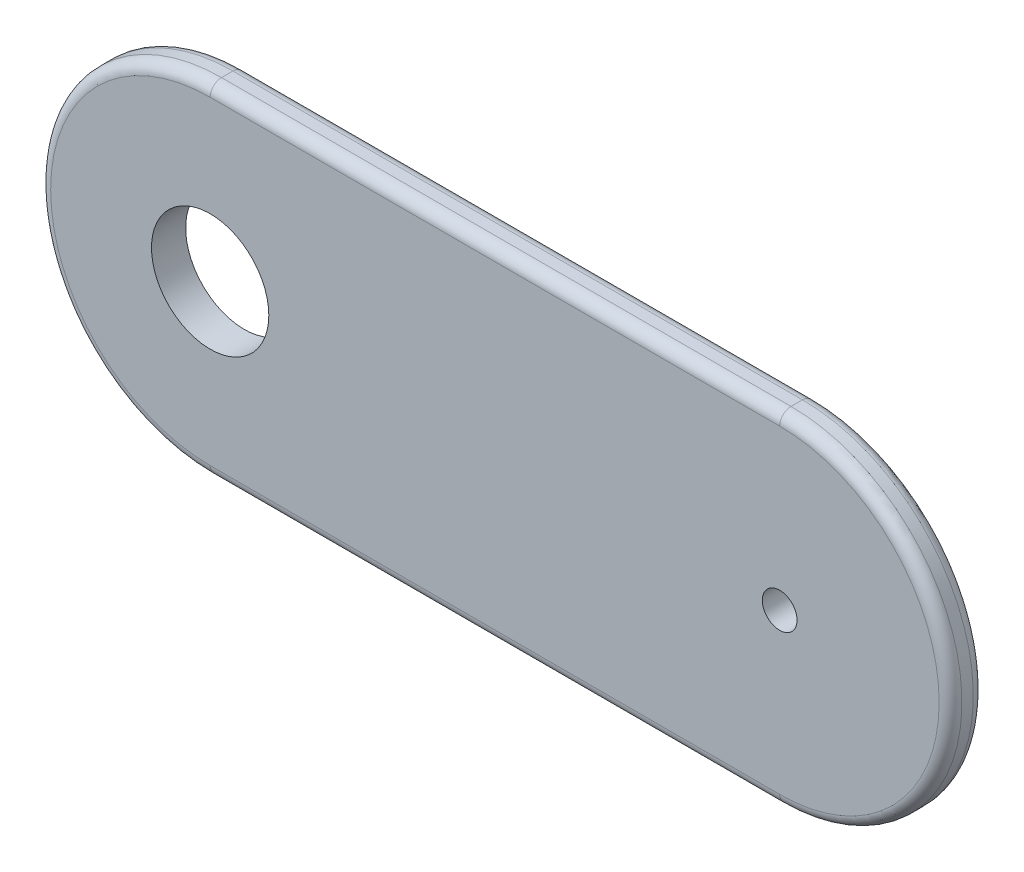
ISO-10303-21;
HEADER;
FILE_DESCRIPTION(('STEP AP214'),'2;1');
FILE_NAME('part.step','',(''),(''),'','','');
FILE_SCHEMA(('AUTOMOTIVE_DESIGN { 1 0 10303 214 1 1 1 1 }'));
ENDSEC;
DATA;
#1=APPLICATION_CONTEXT('core data for automotive mechanical design processes');
#2=APPLICATION_PROTOCOL_DEFINITION('international standard','automotive_design',2000,#1);
#3=PRODUCT_CONTEXT('',#1,'mechanical');
#4=PRODUCT('Part','Part','',(#3));
#5=PRODUCT_RELATED_PRODUCT_CATEGORY('part','',(#4));
#6=PRODUCT_DEFINITION_FORMATION('','',#4);
#7=PRODUCT_DEFINITION_CONTEXT('part definition',#1,'design');
#8=PRODUCT_DEFINITION('design','',#6,#7);
#9=PRODUCT_DEFINITION_SHAPE('','',#8);
#10=(LENGTH_UNIT() NAMED_UNIT(*) SI_UNIT(.MILLI.,.METRE.));
#11=(NAMED_UNIT(*) PLANE_ANGLE_UNIT() SI_UNIT($,.RADIAN.));
#12=(NAMED_UNIT(*) SI_UNIT($,.STERADIAN.) SOLID_ANGLE_UNIT());
#13=UNCERTAINTY_MEASURE_WITH_UNIT(LENGTH_MEASURE(1.E-05),#10,'distance_accuracy_value','');
#14=(GEOMETRIC_REPRESENTATION_CONTEXT(3) GLOBAL_UNCERTAINTY_ASSIGNED_CONTEXT((#13)) GLOBAL_UNIT_ASSIGNED_CONTEXT((#10,
#11,#12)) REPRESENTATION_CONTEXT('',''));
#15=CARTESIAN_POINT('',(0.,0.,0.));
#16=DIRECTION('',(0.,0.,1.));
#17=DIRECTION('',(1.,0.,0.));
#18=AXIS2_PLACEMENT_3D('',#15,#16,#17);
#19=CARTESIAN_POINT('',(0.,0.,3.));
#20=DIRECTION('',(0.,0.,-1.));
#21=DIRECTION('',(-1.,0.,0.));
#22=AXIS2_PLACEMENT_3D('',#19,#20,#21);
#23=CYLINDRICAL_SURFACE('',#22,15.);
#24=DIRECTION('',(0.,0.,-1.));
#25=VECTOR('',#24,1.);
#26=CARTESIAN_POINT('',(0.,15.,3.));
#27=LINE('',#26,#25);
#28=CARTESIAN_POINT('',(0.,15.,2.));
#29=VERTEX_POINT('',#28);
#30=CARTESIAN_POINT('',(0.,15.,1.));
#31=VERTEX_POINT('',#30);
#32=EDGE_CURVE('E175',#29,#31,#27,.T.);
#33=ORIENTED_EDGE('',*,*,#32,.T.);
#34=CARTESIAN_POINT('',(0.,0.,1.));
#35=DIRECTION('',(0.,0.,1.));
#36=DIRECTION('',(1.,0.,0.));
#37=AXIS2_PLACEMENT_3D('',#34,#35,#36);
#38=CIRCLE('',#37,15.);
#39=CARTESIAN_POINT('',(0.,-15.,1.));
#40=VERTEX_POINT('',#39);
#41=EDGE_CURVE('E127',#31,#40,#38,.T.);
#42=ORIENTED_EDGE('',*,*,#41,.T.);
#43=DIRECTION('',(0.,0.,-1.));
#44=VECTOR('',#43,1.);
#45=CARTESIAN_POINT('',(0.,-15.,3.));
#46=LINE('',#45,#44);
#47=CARTESIAN_POINT('',(0.,-15.,2.));
#48=VERTEX_POINT('',#47);
#49=EDGE_CURVE('E111',#48,#40,#46,.T.);
#50=ORIENTED_EDGE('',*,*,#49,.F.);
#51=CARTESIAN_POINT('',(0.,0.,2.));
#52=DIRECTION('',(0.,0.,1.));
#53=DIRECTION('',(1.,0.,0.));
#54=AXIS2_PLACEMENT_3D('',#51,#52,#53);
#55=CIRCLE('',#54,15.);
#56=EDGE_CURVE('E124',#48,#29,#55,.F.);
#57=ORIENTED_EDGE('',*,*,#56,.T.);
#58=EDGE_LOOP('',(#33,#42,#50,#57));
#59=FACE_BOUND('',#58,.T.);
#60=ADVANCED_FACE('F39',(#59),#23,.T.);
#61=CARTESIAN_POINT('',(0.,-15.,3.));
#62=DIRECTION('',(0.,1.,0.));
#63=DIRECTION('',(0.,0.,1.));
#64=AXIS2_PLACEMENT_3D('',#61,#62,#63);
#65=PLANE('',#64);
#66=ORIENTED_EDGE('',*,*,#49,.T.);
#67=DIRECTION('',(1.,0.,0.));
#68=VECTOR('',#67,1.);
#69=CARTESIAN_POINT('',(0.,-15.,1.));
#70=LINE('',#69,#68);
#71=CARTESIAN_POINT('',(50.,-15.,1.));
#72=VERTEX_POINT('',#71);
#73=EDGE_CURVE('E117',#40,#72,#70,.T.);
#74=ORIENTED_EDGE('',*,*,#73,.T.);
#75=DIRECTION('',(0.,0.,-1.));
#76=VECTOR('',#75,1.);
#77=CARTESIAN_POINT('',(50.,-15.,3.));
#78=LINE('',#77,#76);
#79=CARTESIAN_POINT('',(50.,-15.,2.));
#80=VERTEX_POINT('',#79);
#81=EDGE_CURVE('E113',#80,#72,#78,.T.);
#82=ORIENTED_EDGE('',*,*,#81,.F.);
#83=DIRECTION('',(1.,0.,0.));
#84=VECTOR('',#83,1.);
#85=CARTESIAN_POINT('',(0.,-15.,2.));
#86=LINE('',#85,#84);
#87=EDGE_CURVE('E108',#80,#48,#86,.F.);
#88=ORIENTED_EDGE('',*,*,#87,.T.);
#89=EDGE_LOOP('',(#66,#74,#82,#88));
#90=FACE_BOUND('',#89,.T.);
#91=ADVANCED_FACE('F110',(#90),#65,.F.);
#92=CARTESIAN_POINT('',(50.,0.,3.));
#93=DIRECTION('',(0.,0.,-1.));
#94=DIRECTION('',(-1.,0.,0.));
#95=AXIS2_PLACEMENT_3D('',#92,#93,#94);
#96=CYLINDRICAL_SURFACE('',#95,15.);
#97=ORIENTED_EDGE('',*,*,#81,.T.);
#98=CARTESIAN_POINT('',(50.,0.,1.));
#99=DIRECTION('',(0.,0.,1.));
#100=DIRECTION('',(1.,0.,0.));
#101=AXIS2_PLACEMENT_3D('',#98,#99,#100);
#102=CIRCLE('',#101,15.);
#103=CARTESIAN_POINT('',(50.,15.,1.));
#104=VERTEX_POINT('',#103);
#105=EDGE_CURVE('E196',#72,#104,#102,.T.);
#106=ORIENTED_EDGE('',*,*,#105,.T.);
#107=DIRECTION('',(0.,0.,-1.));
#108=VECTOR('',#107,1.);
#109=CARTESIAN_POINT('',(50.,15.,3.));
#110=LINE('',#109,#108);
#111=CARTESIAN_POINT('',(50.,15.,2.));
#112=VERTEX_POINT('',#111);
#113=EDGE_CURVE('E180',#112,#104,#110,.T.);
#114=ORIENTED_EDGE('',*,*,#113,.F.);
#115=CARTESIAN_POINT('',(50.,0.,2.));
#116=DIRECTION('',(0.,0.,1.));
#117=DIRECTION('',(1.,0.,0.));
#118=AXIS2_PLACEMENT_3D('',#115,#116,#117);
#119=CIRCLE('',#118,15.);
#120=EDGE_CURVE('E194',#112,#80,#119,.F.);
#121=ORIENTED_EDGE('',*,*,#120,.T.);
#122=EDGE_LOOP('',(#97,#106,#114,#121));
#123=FACE_BOUND('',#122,.T.);
#124=ADVANCED_FACE('F209',(#123),#96,.T.);
#125=CARTESIAN_POINT('',(0.,15.,3.));
#126=DIRECTION('',(0.,1.,0.));
#127=DIRECTION('',(0.,0.,1.));
#128=AXIS2_PLACEMENT_3D('',#125,#126,#127);
#129=PLANE('',#128);
#130=ORIENTED_EDGE('',*,*,#113,.T.);
#131=DIRECTION('',(1.,0.,0.));
#132=VECTOR('',#131,1.);
#133=CARTESIAN_POINT('',(0.,15.,1.));
#134=LINE('',#133,#132);
#135=EDGE_CURVE('E11',#104,#31,#134,.F.);
#136=ORIENTED_EDGE('',*,*,#135,.T.);
#137=ORIENTED_EDGE('',*,*,#32,.F.);
#138=DIRECTION('',(1.,0.,0.));
#139=VECTOR('',#138,1.);
#140=CARTESIAN_POINT('',(0.,15.,2.));
#141=LINE('',#140,#139);
#142=EDGE_CURVE('E48',#29,#112,#141,.T.);
#143=ORIENTED_EDGE('',*,*,#142,.T.);
#144=EDGE_LOOP('',(#130,#136,#137,#143));
#145=FACE_BOUND('',#144,.T.);
#146=ADVANCED_FACE('F206',(#145),#129,.T.);
#147=CARTESIAN_POINT('',(0.,0.,3.));
#148=DIRECTION('',(0.,0.,1.));
#149=DIRECTION('',(1.,0.,0.));
#150=AXIS2_PLACEMENT_3D('',#147,#148,#149);
#151=PLANE('',#150);
#152=CARTESIAN_POINT('',(0.,0.,3.));
#153=DIRECTION('',(0.,0.,1.));
#154=DIRECTION('',(1.,0.,0.));
#155=AXIS2_PLACEMENT_3D('',#152,#153,#154);
#156=CIRCLE('',#155,5.15);
#157=CARTESIAN_POINT('',(5.15,0.,3.));
#158=VERTEX_POINT('',#157);
#159=EDGE_CURVE('E139',#158,#158,#156,.T.);
#160=ORIENTED_EDGE('',*,*,#159,.F.);
#161=EDGE_LOOP('',(#160));
#162=FACE_BOUND('',#161,.T.);
#163=DIRECTION('',(1.,0.,0.));
#164=VECTOR('',#163,1.);
#165=CARTESIAN_POINT('',(0.,14.,3.));
#166=LINE('',#165,#164);
#167=CARTESIAN_POINT('',(50.,14.,3.));
#168=VERTEX_POINT('',#167);
#169=CARTESIAN_POINT('',(0.,14.,3.));
#170=VERTEX_POINT('',#169);
#171=EDGE_CURVE('E198',#168,#170,#166,.F.);
#172=ORIENTED_EDGE('',*,*,#171,.T.);
#173=CARTESIAN_POINT('',(0.,0.,3.));
#174=DIRECTION('',(0.,0.,1.));
#175=DIRECTION('',(1.,0.,0.));
#176=AXIS2_PLACEMENT_3D('',#173,#174,#175);
#177=CIRCLE('',#176,14.);
#178=CARTESIAN_POINT('',(0.,-14.,3.));
#179=VERTEX_POINT('',#178);
#180=EDGE_CURVE('E203',#170,#179,#177,.T.);
#181=ORIENTED_EDGE('',*,*,#180,.T.);
#182=DIRECTION('',(1.,0.,0.));
#183=VECTOR('',#182,1.);
#184=CARTESIAN_POINT('',(50.,-14.,3.));
#185=LINE('',#184,#183);
#186=CARTESIAN_POINT('',(50.,-14.,3.));
#187=VERTEX_POINT('',#186);
#188=EDGE_CURVE('E63',#179,#187,#185,.T.);
#189=ORIENTED_EDGE('',*,*,#188,.T.);
#190=CARTESIAN_POINT('',(50.,0.,3.));
#191=DIRECTION('',(0.,0.,1.));
#192=DIRECTION('',(1.,0.,0.));
#193=AXIS2_PLACEMENT_3D('',#190,#191,#192);
#194=CIRCLE('',#193,14.);
#195=EDGE_CURVE('E200',#187,#168,#194,.T.);
#196=ORIENTED_EDGE('',*,*,#195,.T.);
#197=EDGE_LOOP('',(#172,#181,#189,#196));
#198=FACE_BOUND('',#197,.T.);
#199=CARTESIAN_POINT('',(50.,0.,3.));
#200=DIRECTION('',(0.,0.,1.));
#201=DIRECTION('',(1.,0.,0.));
#202=AXIS2_PLACEMENT_3D('',#199,#200,#201);
#203=CIRCLE('',#202,1.525);
#204=CARTESIAN_POINT('',(51.525,0.,3.));
#205=VERTEX_POINT('',#204);
#206=EDGE_CURVE('E170',#205,#205,#203,.F.);
#207=ORIENTED_EDGE('',*,*,#206,.T.);
#208=EDGE_LOOP('',(#207));
#209=FACE_BOUND('',#208,.T.);
#210=ADVANCED_FACE('F212',(#162,#198,#209),#151,.T.);
#211=CARTESIAN_POINT('',(0.,0.,0.));
#212=DIRECTION('',(0.,0.,1.));
#213=DIRECTION('',(1.,0.,0.));
#214=AXIS2_PLACEMENT_3D('',#211,#212,#213);
#215=PLANE('',#214);
#216=CARTESIAN_POINT('',(0.,0.,0.));
#217=DIRECTION('',(0.,0.,1.));
#218=DIRECTION('',(1.,0.,0.));
#219=AXIS2_PLACEMENT_3D('',#216,#217,#218);
#220=CIRCLE('',#219,5.15);
#221=CARTESIAN_POINT('',(5.15,0.,0.));
#222=VERTEX_POINT('',#221);
#223=EDGE_CURVE('E43',#222,#222,#220,.T.);
#224=ORIENTED_EDGE('',*,*,#223,.T.);
#225=EDGE_LOOP('',(#224));
#226=FACE_BOUND('',#225,.T.);
#227=DIRECTION('',(1.,0.,0.));
#228=VECTOR('',#227,1.);
#229=CARTESIAN_POINT('',(0.,-14.,0.));
#230=LINE('',#229,#228);
#231=CARTESIAN_POINT('',(50.,-14.,0.));
#232=VERTEX_POINT('',#231);
#233=CARTESIAN_POINT('',(0.,-14.,0.));
#234=VERTEX_POINT('',#233);
#235=EDGE_CURVE('E189',#232,#234,#230,.F.);
#236=ORIENTED_EDGE('',*,*,#235,.T.);
#237=CARTESIAN_POINT('',(0.,0.,0.));
#238=DIRECTION('',(0.,0.,1.));
#239=DIRECTION('',(1.,0.,0.));
#240=AXIS2_PLACEMENT_3D('',#237,#238,#239);
#241=CIRCLE('',#240,14.);
#242=CARTESIAN_POINT('',(0.,14.,0.));
#243=VERTEX_POINT('',#242);
#244=EDGE_CURVE('E118',#234,#243,#241,.F.);
#245=ORIENTED_EDGE('',*,*,#244,.T.);
#246=DIRECTION('',(1.,0.,0.));
#247=VECTOR('',#246,1.);
#248=CARTESIAN_POINT('',(50.,14.,0.));
#249=LINE('',#248,#247);
#250=CARTESIAN_POINT('',(50.,14.,0.));
#251=VERTEX_POINT('',#250);
#252=EDGE_CURVE('E185',#243,#251,#249,.T.);
#253=ORIENTED_EDGE('',*,*,#252,.T.);
#254=CARTESIAN_POINT('',(50.,0.,0.));
#255=DIRECTION('',(0.,0.,1.));
#256=DIRECTION('',(1.,0.,0.));
#257=AXIS2_PLACEMENT_3D('',#254,#255,#256);
#258=CIRCLE('',#257,14.);
#259=EDGE_CURVE('E187',#251,#232,#258,.F.);
#260=ORIENTED_EDGE('',*,*,#259,.T.);
#261=EDGE_LOOP('',(#236,#245,#253,#260));
#262=FACE_BOUND('',#261,.T.);
#263=CARTESIAN_POINT('',(50.,0.,0.));
#264=DIRECTION('',(0.,0.,1.));
#265=DIRECTION('',(1.,0.,0.));
#266=AXIS2_PLACEMENT_3D('',#263,#264,#265);
#267=CIRCLE('',#266,1.525);
#268=CARTESIAN_POINT('',(51.525,0.,0.));
#269=VERTEX_POINT('',#268);
#270=EDGE_CURVE('E164',#269,#269,#267,.T.);
#271=ORIENTED_EDGE('',*,*,#270,.T.);
#272=EDGE_LOOP('',(#271));
#273=FACE_BOUND('',#272,.T.);
#274=ADVANCED_FACE('F257',(#226,#262,#273),#215,.F.);
#275=CARTESIAN_POINT('',(50.,0.,5.));
#276=DIRECTION('',(0.,0.,-1.));
#277=DIRECTION('',(-1.,0.,0.));
#278=AXIS2_PLACEMENT_3D('',#275,#276,#277);
#279=CYLINDRICAL_SURFACE('',#278,1.525);
#280=ORIENTED_EDGE('',*,*,#206,.F.);
#281=EDGE_LOOP('',(#280));
#282=FACE_BOUND('',#281,.T.);
#283=ORIENTED_EDGE('',*,*,#270,.F.);
#284=EDGE_LOOP('',(#283));
#285=FACE_BOUND('',#284,.T.);
#286=ADVANCED_FACE('F241',(#282,#285),#279,.F.);
#287=CARTESIAN_POINT('',(50.,0.,1.));
#288=DIRECTION('',(0.,0.,1.));
#289=DIRECTION('',(1.,0.,0.));
#290=AXIS2_PLACEMENT_3D('',#287,#288,#289);
#291=TOROIDAL_SURFACE('',#290,14.,1.);
#292=CARTESIAN_POINT('',(50.,-14.,1.));
#293=DIRECTION('',(-1.,0.,0.));
#294=DIRECTION('',(0.,0.,1.));
#295=AXIS2_PLACEMENT_3D('',#292,#293,#294);
#296=CIRCLE('',#295,1.);
#297=EDGE_CURVE('E156',#232,#72,#296,.T.);
#298=ORIENTED_EDGE('',*,*,#297,.F.);
#299=ORIENTED_EDGE('',*,*,#259,.F.);
#300=CARTESIAN_POINT('',(50.,14.,1.));
#301=DIRECTION('',(-1.,0.,0.));
#302=DIRECTION('',(0.,0.,1.));
#303=AXIS2_PLACEMENT_3D('',#300,#301,#302);
#304=CIRCLE('',#303,1.);
#305=EDGE_CURVE('E141',#104,#251,#304,.T.);
#306=ORIENTED_EDGE('',*,*,#305,.F.);
#307=ORIENTED_EDGE('',*,*,#105,.F.);
#308=EDGE_LOOP('',(#298,#299,#306,#307));
#309=FACE_BOUND('',#308,.T.);
#310=ADVANCED_FACE('F238',(#309),#291,.T.);
#311=CARTESIAN_POINT('',(0.,14.,1.));
#312=DIRECTION('',(-1.,0.,0.));
#313=DIRECTION('',(0.,0.,1.));
#314=AXIS2_PLACEMENT_3D('',#311,#312,#313);
#315=CYLINDRICAL_SURFACE('',#314,1.);
#316=ORIENTED_EDGE('',*,*,#305,.T.);
#317=ORIENTED_EDGE('',*,*,#252,.F.);
#318=CARTESIAN_POINT('',(0.,14.,1.));
#319=DIRECTION('',(-1.,0.,0.));
#320=DIRECTION('',(0.,0.,1.));
#321=AXIS2_PLACEMENT_3D('',#318,#319,#320);
#322=CIRCLE('',#321,1.);
#323=EDGE_CURVE('E150',#31,#243,#322,.T.);
#324=ORIENTED_EDGE('',*,*,#323,.F.);
#325=ORIENTED_EDGE('',*,*,#135,.F.);
#326=EDGE_LOOP('',(#316,#317,#324,#325));
#327=FACE_BOUND('',#326,.T.);
#328=ADVANCED_FACE('F235',(#327),#315,.T.);
#329=CARTESIAN_POINT('',(0.,-14.,1.));
#330=DIRECTION('',(1.,0.,0.));
#331=DIRECTION('',(0.,0.,-1.));
#332=AXIS2_PLACEMENT_3D('',#329,#330,#331);
#333=CYLINDRICAL_SURFACE('',#332,1.);
#334=ORIENTED_EDGE('',*,*,#297,.T.);
#335=ORIENTED_EDGE('',*,*,#73,.F.);
#336=CARTESIAN_POINT('',(0.,-14.,1.));
#337=DIRECTION('',(-1.,0.,0.));
#338=DIRECTION('',(0.,0.,1.));
#339=AXIS2_PLACEMENT_3D('',#336,#337,#338);
#340=CIRCLE('',#339,1.);
#341=EDGE_CURVE('E146',#234,#40,#340,.T.);
#342=ORIENTED_EDGE('',*,*,#341,.F.);
#343=ORIENTED_EDGE('',*,*,#235,.F.);
#344=EDGE_LOOP('',(#334,#335,#342,#343));
#345=FACE_BOUND('',#344,.T.);
#346=ADVANCED_FACE('F232',(#345),#333,.T.);
#347=CARTESIAN_POINT('',(0.,0.,1.));
#348=DIRECTION('',(0.,0.,1.));
#349=DIRECTION('',(1.,0.,0.));
#350=AXIS2_PLACEMENT_3D('',#347,#348,#349);
#351=TOROIDAL_SURFACE('',#350,14.,1.);
#352=ORIENTED_EDGE('',*,*,#323,.T.);
#353=ORIENTED_EDGE('',*,*,#244,.F.);
#354=ORIENTED_EDGE('',*,*,#341,.T.);
#355=ORIENTED_EDGE('',*,*,#41,.F.);
#356=EDGE_LOOP('',(#352,#353,#354,#355));
#357=FACE_BOUND('',#356,.T.);
#358=ADVANCED_FACE('F221',(#357),#351,.T.);
#359=CARTESIAN_POINT('',(50.,0.,2.));
#360=DIRECTION('',(0.,0.,1.));
#361=DIRECTION('',(1.,0.,0.));
#362=AXIS2_PLACEMENT_3D('',#359,#360,#361);
#363=TOROIDAL_SURFACE('',#362,14.,1.);
#364=CARTESIAN_POINT('',(50.,-14.,2.));
#365=DIRECTION('',(-1.,0.,0.));
#366=DIRECTION('',(0.,0.,1.));
#367=AXIS2_PLACEMENT_3D('',#364,#365,#366);
#368=CIRCLE('',#367,1.);
#369=EDGE_CURVE('E136',#80,#187,#368,.T.);
#370=ORIENTED_EDGE('',*,*,#369,.F.);
#371=ORIENTED_EDGE('',*,*,#120,.F.);
#372=CARTESIAN_POINT('',(50.,14.,2.));
#373=DIRECTION('',(-1.,0.,0.));
#374=DIRECTION('',(0.,0.,1.));
#375=AXIS2_PLACEMENT_3D('',#372,#373,#374);
#376=CIRCLE('',#375,1.);
#377=EDGE_CURVE('E144',#168,#112,#376,.T.);
#378=ORIENTED_EDGE('',*,*,#377,.F.);
#379=ORIENTED_EDGE('',*,*,#195,.F.);
#380=EDGE_LOOP('',(#370,#371,#378,#379));
#381=FACE_BOUND('',#380,.T.);
#382=ADVANCED_FACE('F41',(#381),#363,.T.);
#383=CARTESIAN_POINT('',(0.,14.,2.));
#384=DIRECTION('',(1.,0.,0.));
#385=DIRECTION('',(0.,0.,-1.));
#386=AXIS2_PLACEMENT_3D('',#383,#384,#385);
#387=CYLINDRICAL_SURFACE('',#386,1.);
#388=ORIENTED_EDGE('',*,*,#377,.T.);
#389=ORIENTED_EDGE('',*,*,#142,.F.);
#390=CARTESIAN_POINT('',(0.,14.,2.));
#391=DIRECTION('',(-1.,0.,0.));
#392=DIRECTION('',(0.,0.,1.));
#393=AXIS2_PLACEMENT_3D('',#390,#391,#392);
#394=CIRCLE('',#393,1.);
#395=EDGE_CURVE('E131',#170,#29,#394,.T.);
#396=ORIENTED_EDGE('',*,*,#395,.F.);
#397=ORIENTED_EDGE('',*,*,#171,.F.);
#398=EDGE_LOOP('',(#388,#389,#396,#397));
#399=FACE_BOUND('',#398,.T.);
#400=ADVANCED_FACE('F214',(#399),#387,.T.);
#401=CARTESIAN_POINT('',(0.,-14.,2.));
#402=DIRECTION('',(-1.,0.,0.));
#403=DIRECTION('',(0.,0.,1.));
#404=AXIS2_PLACEMENT_3D('',#401,#402,#403);
#405=CYLINDRICAL_SURFACE('',#404,1.);
#406=ORIENTED_EDGE('',*,*,#369,.T.);
#407=ORIENTED_EDGE('',*,*,#188,.F.);
#408=CARTESIAN_POINT('',(0.,-14.,2.));
#409=DIRECTION('',(-1.,0.,0.));
#410=DIRECTION('',(0.,0.,1.));
#411=AXIS2_PLACEMENT_3D('',#408,#409,#410);
#412=CIRCLE('',#411,1.);
#413=EDGE_CURVE('E56',#48,#179,#412,.T.);
#414=ORIENTED_EDGE('',*,*,#413,.F.);
#415=ORIENTED_EDGE('',*,*,#87,.F.);
#416=EDGE_LOOP('',(#406,#407,#414,#415));
#417=FACE_BOUND('',#416,.T.);
#418=ADVANCED_FACE('F134',(#417),#405,.T.);
#419=CARTESIAN_POINT('',(0.,0.,2.));
#420=DIRECTION('',(0.,0.,1.));
#421=DIRECTION('',(1.,0.,0.));
#422=AXIS2_PLACEMENT_3D('',#419,#420,#421);
#423=TOROIDAL_SURFACE('',#422,14.,1.);
#424=ORIENTED_EDGE('',*,*,#395,.T.);
#425=ORIENTED_EDGE('',*,*,#56,.F.);
#426=ORIENTED_EDGE('',*,*,#413,.T.);
#427=ORIENTED_EDGE('',*,*,#180,.F.);
#428=EDGE_LOOP('',(#424,#425,#426,#427));
#429=FACE_BOUND('',#428,.T.);
#430=ADVANCED_FACE('F129',(#429),#423,.T.);
#431=CARTESIAN_POINT('',(0.,0.,-2.));
#432=DIRECTION('',(0.,0.,1.));
#433=DIRECTION('',(1.,0.,0.));
#434=AXIS2_PLACEMENT_3D('',#431,#432,#433);
#435=CYLINDRICAL_SURFACE('',#434,5.15);
#436=ORIENTED_EDGE('',*,*,#159,.T.);
#437=EDGE_LOOP('',(#436));
#438=FACE_BOUND('',#437,.T.);
#439=ORIENTED_EDGE('',*,*,#223,.F.);
#440=EDGE_LOOP('',(#439));
#441=FACE_BOUND('',#440,.T.);
#442=ADVANCED_FACE('F244',(#438,#441),#435,.F.);
#443=CLOSED_SHELL('',(#60,#91,#124,#146,#210,#274,#286,#310,#328,#346,#358,#382,#400,#418,#430,#442));
#444=MANIFOLD_SOLID_BREP('B2',#443);
#445=ADVANCED_BREP_SHAPE_REPRESENTATION('',(#18,#444),#14);
#446=SHAPE_DEFINITION_REPRESENTATION(#9,#445);
ENDSEC;
END-ISO-10303-21;
